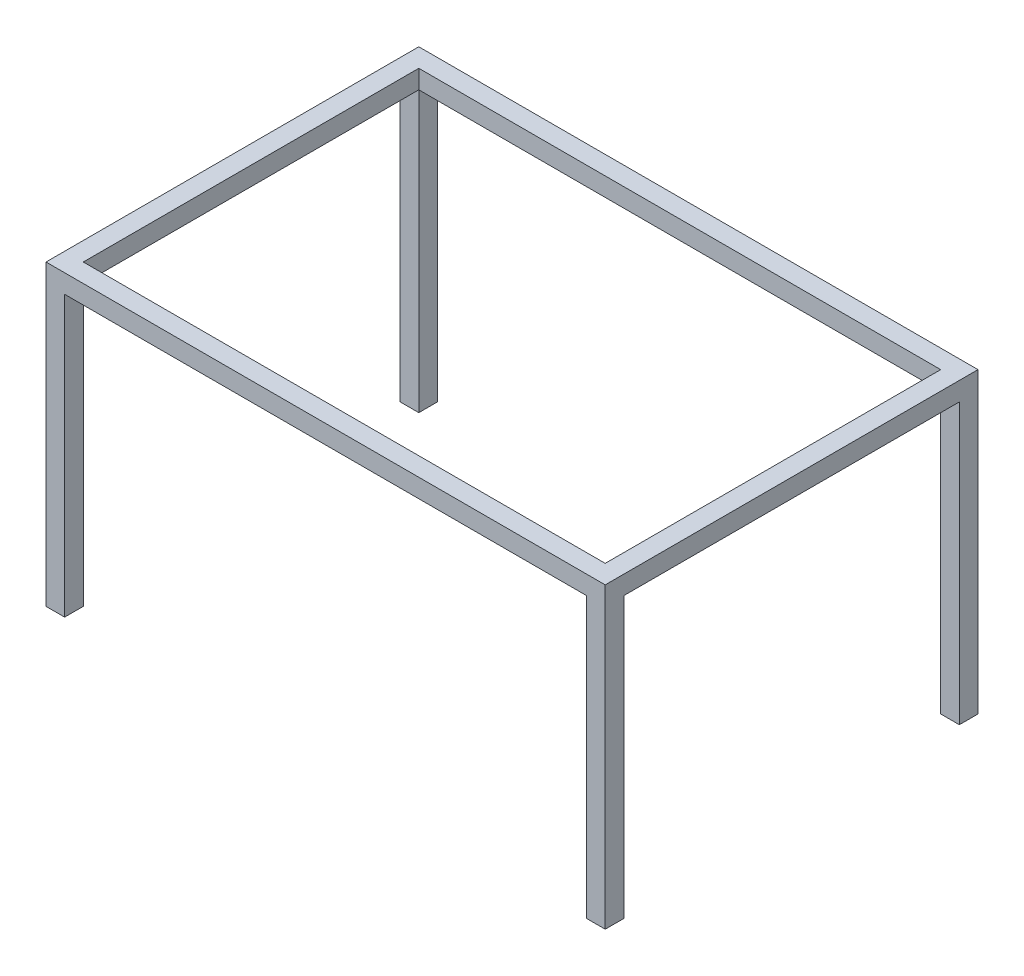
ISO-10303-21;
HEADER;
FILE_DESCRIPTION(('STEP AP214'),'2;1');
FILE_NAME('part.step','',(''),(''),'','','');
FILE_SCHEMA(('AUTOMOTIVE_DESIGN { 1 0 10303 214 1 1 1 1 }'));
ENDSEC;
DATA;
#1=APPLICATION_CONTEXT('core data for automotive mechanical design processes');
#2=APPLICATION_PROTOCOL_DEFINITION('international standard','automotive_design',2000,#1);
#3=PRODUCT_CONTEXT('',#1,'mechanical');
#4=PRODUCT('Part','Part','',(#3));
#5=PRODUCT_RELATED_PRODUCT_CATEGORY('part','',(#4));
#6=PRODUCT_DEFINITION_FORMATION('','',#4);
#7=PRODUCT_DEFINITION_CONTEXT('part definition',#1,'design');
#8=PRODUCT_DEFINITION('design','',#6,#7);
#9=PRODUCT_DEFINITION_SHAPE('','',#8);
#10=(LENGTH_UNIT() NAMED_UNIT(*) SI_UNIT(.MILLI.,.METRE.));
#11=(NAMED_UNIT(*) PLANE_ANGLE_UNIT() SI_UNIT($,.RADIAN.));
#12=(NAMED_UNIT(*) SI_UNIT($,.STERADIAN.) SOLID_ANGLE_UNIT());
#13=UNCERTAINTY_MEASURE_WITH_UNIT(LENGTH_MEASURE(1.E-05),#10,'distance_accuracy_value','');
#14=(GEOMETRIC_REPRESENTATION_CONTEXT(3) GLOBAL_UNCERTAINTY_ASSIGNED_CONTEXT((#13)) GLOBAL_UNIT_ASSIGNED_CONTEXT((#10,
#11,#12)) REPRESENTATION_CONTEXT('',''));
#15=CARTESIAN_POINT('',(0.,0.,0.));
#16=DIRECTION('',(0.,0.,1.));
#17=DIRECTION('',(1.,0.,0.));
#18=AXIS2_PLACEMENT_3D('',#15,#16,#17);
#19=CARTESIAN_POINT('',(0.,0.,0.));
#20=DIRECTION('',(0.,-1.,0.));
#21=DIRECTION('',(0.,0.,-1.));
#22=AXIS2_PLACEMENT_3D('',#19,#20,#21);
#23=PLANE('',#22);
#24=DIRECTION('',(1.,0.,0.));
#25=VECTOR('',#24,1.);
#26=CARTESIAN_POINT('',(-1400.,0.,900.));
#27=LINE('',#26,#25);
#28=CARTESIAN_POINT('',(-1400.,0.,900.));
#29=VERTEX_POINT('',#28);
#30=CARTESIAN_POINT('',(1400.,0.,900.));
#31=VERTEX_POINT('',#30);
#32=EDGE_CURVE('E269',#29,#31,#27,.T.);
#33=ORIENTED_EDGE('',*,*,#32,.T.);
#34=DIRECTION('',(0.,0.,-1.));
#35=VECTOR('',#34,1.);
#36=CARTESIAN_POINT('',(1400.,0.,900.));
#37=LINE('',#36,#35);
#38=CARTESIAN_POINT('',(1400.,0.,1000.));
#39=VERTEX_POINT('',#38);
#40=EDGE_CURVE('E182',#39,#31,#37,.T.);
#41=ORIENTED_EDGE('',*,*,#40,.F.);
#42=DIRECTION('',(1.,0.,0.));
#43=VECTOR('',#42,1.);
#44=CARTESIAN_POINT('',(-1500.,0.,1000.));
#45=LINE('',#44,#43);
#46=CARTESIAN_POINT('',(-1400.,0.,1000.));
#47=VERTEX_POINT('',#46);
#48=EDGE_CURVE('E293',#47,#39,#45,.T.);
#49=ORIENTED_EDGE('',*,*,#48,.F.);
#50=DIRECTION('',(0.,0.,1.));
#51=VECTOR('',#50,1.);
#52=CARTESIAN_POINT('',(-1400.,0.,1000.));
#53=LINE('',#52,#51);
#54=EDGE_CURVE('E236',#29,#47,#53,.T.);
#55=ORIENTED_EDGE('',*,*,#54,.F.);
#56=EDGE_LOOP('',(#33,#41,#49,#55));
#57=FACE_BOUND('',#56,.T.);
#58=ADVANCED_FACE('F33',(#57),#23,.T.);
#59=DIRECTION('',(0.,0.,-1.));
#60=VECTOR('',#59,1.);
#61=CARTESIAN_POINT('',(1500.,0.,1000.));
#62=LINE('',#61,#60);
#63=CARTESIAN_POINT('',(1500.,0.,900.));
#64=VERTEX_POINT('',#63);
#65=CARTESIAN_POINT('',(1500.,0.,-899.999999999999));
#66=VERTEX_POINT('',#65);
#67=EDGE_CURVE('E288',#64,#66,#62,.T.);
#68=ORIENTED_EDGE('',*,*,#67,.F.);
#69=DIRECTION('',(1.,0.,0.));
#70=VECTOR('',#69,1.);
#71=CARTESIAN_POINT('',(1400.,0.,900.));
#72=LINE('',#71,#70);
#73=EDGE_CURVE('E178',#31,#64,#72,.T.);
#74=ORIENTED_EDGE('',*,*,#73,.F.);
#75=DIRECTION('',(0.,0.,-1.));
#76=VECTOR('',#75,1.);
#77=CARTESIAN_POINT('',(1400.,0.,900.));
#78=LINE('',#77,#76);
#79=CARTESIAN_POINT('',(1400.,0.,-899.999999999999));
#80=VERTEX_POINT('',#79);
#81=EDGE_CURVE('E272',#31,#80,#78,.T.);
#82=ORIENTED_EDGE('',*,*,#81,.T.);
#83=DIRECTION('',(-1.,0.,0.));
#84=VECTOR('',#83,1.);
#85=CARTESIAN_POINT('',(1500.,0.,-899.999999999999));
#86=LINE('',#85,#84);
#87=EDGE_CURVE('E184',#66,#80,#86,.T.);
#88=ORIENTED_EDGE('',*,*,#87,.F.);
#89=EDGE_LOOP('',(#68,#74,#82,#88));
#90=FACE_BOUND('',#89,.T.);
#91=ADVANCED_FACE('F363',(#90),#23,.T.);
#92=DIRECTION('',(-1.,0.,0.));
#93=VECTOR('',#92,1.);
#94=CARTESIAN_POINT('',(-1500.,0.,-1000.));
#95=LINE('',#94,#93);
#96=CARTESIAN_POINT('',(1400.,0.,-1000.));
#97=VERTEX_POINT('',#96);
#98=CARTESIAN_POINT('',(-1400.,0.,-1000.));
#99=VERTEX_POINT('',#98);
#100=EDGE_CURVE('E301',#97,#99,#95,.T.);
#101=ORIENTED_EDGE('',*,*,#100,.F.);
#102=DIRECTION('',(0.,0.,-1.));
#103=VECTOR('',#102,1.);
#104=CARTESIAN_POINT('',(1400.,0.,-1000.));
#105=LINE('',#104,#103);
#106=EDGE_CURVE('E186',#80,#97,#105,.T.);
#107=ORIENTED_EDGE('',*,*,#106,.F.);
#108=DIRECTION('',(-1.,0.,0.));
#109=VECTOR('',#108,1.);
#110=CARTESIAN_POINT('',(-1400.,0.,-900.));
#111=LINE('',#110,#109);
#112=CARTESIAN_POINT('',(-1400.,0.,-900.));
#113=VERTEX_POINT('',#112);
#114=EDGE_CURVE('E260',#80,#113,#111,.T.);
#115=ORIENTED_EDGE('',*,*,#114,.T.);
#116=DIRECTION('',(0.,0.,1.));
#117=VECTOR('',#116,1.);
#118=CARTESIAN_POINT('',(-1400.,0.,-900.));
#119=LINE('',#118,#117);
#120=EDGE_CURVE('E210',#99,#113,#119,.T.);
#121=ORIENTED_EDGE('',*,*,#120,.F.);
#122=EDGE_LOOP('',(#101,#107,#115,#121));
#123=FACE_BOUND('',#122,.T.);
#124=ADVANCED_FACE('F398',(#123),#23,.T.);
#125=DIRECTION('',(0.,0.,1.));
#126=VECTOR('',#125,1.);
#127=CARTESIAN_POINT('',(-1500.,0.,1000.));
#128=LINE('',#127,#126);
#129=CARTESIAN_POINT('',(-1500.,0.,-899.999999999999));
#130=VERTEX_POINT('',#129);
#131=CARTESIAN_POINT('',(-1500.,0.,900.));
#132=VERTEX_POINT('',#131);
#133=EDGE_CURVE('E303',#130,#132,#128,.T.);
#134=ORIENTED_EDGE('',*,*,#133,.F.);
#135=DIRECTION('',(-1.,0.,0.));
#136=VECTOR('',#135,1.);
#137=CARTESIAN_POINT('',(-1400.,0.,-900.));
#138=LINE('',#137,#136);
#139=EDGE_CURVE('E215',#113,#130,#138,.T.);
#140=ORIENTED_EDGE('',*,*,#139,.F.);
#141=DIRECTION('',(0.,0.,1.));
#142=VECTOR('',#141,1.);
#143=CARTESIAN_POINT('',(-1400.,0.,900.));
#144=LINE('',#143,#142);
#145=EDGE_CURVE('E256',#113,#29,#144,.T.);
#146=ORIENTED_EDGE('',*,*,#145,.T.);
#147=DIRECTION('',(1.,0.,0.));
#148=VECTOR('',#147,1.);
#149=CARTESIAN_POINT('',(-1500.,0.,900.));
#150=LINE('',#149,#148);
#151=EDGE_CURVE('E231',#132,#29,#150,.T.);
#152=ORIENTED_EDGE('',*,*,#151,.F.);
#153=EDGE_LOOP('',(#134,#140,#146,#152));
#154=FACE_BOUND('',#153,.T.);
#155=ADVANCED_FACE('F331',(#154),#23,.T.);
#156=CARTESIAN_POINT('',(0.,100.,0.));
#157=DIRECTION('',(0.,-1.,0.));
#158=DIRECTION('',(0.,0.,-1.));
#159=AXIS2_PLACEMENT_3D('',#156,#157,#158);
#160=PLANE('',#159);
#161=DIRECTION('',(0.,0.,-1.));
#162=VECTOR('',#161,1.);
#163=CARTESIAN_POINT('',(1500.,100.,1000.));
#164=LINE('',#163,#162);
#165=CARTESIAN_POINT('',(1500.,100.,1000.));
#166=VERTEX_POINT('',#165);
#167=CARTESIAN_POINT('',(1500.,100.,-1000.));
#168=VERTEX_POINT('',#167);
#169=EDGE_CURVE('E289',#166,#168,#164,.T.);
#170=ORIENTED_EDGE('',*,*,#169,.T.);
#171=DIRECTION('',(-1.,0.,0.));
#172=VECTOR('',#171,1.);
#173=CARTESIAN_POINT('',(-1500.,100.,-1000.));
#174=LINE('',#173,#172);
#175=CARTESIAN_POINT('',(-1500.,100.,-1000.));
#176=VERTEX_POINT('',#175);
#177=EDGE_CURVE('E292',#168,#176,#174,.T.);
#178=ORIENTED_EDGE('',*,*,#177,.T.);
#179=DIRECTION('',(0.,0.,1.));
#180=VECTOR('',#179,1.);
#181=CARTESIAN_POINT('',(-1500.,100.,1000.));
#182=LINE('',#181,#180);
#183=CARTESIAN_POINT('',(-1500.,100.,1000.));
#184=VERTEX_POINT('',#183);
#185=EDGE_CURVE('E295',#176,#184,#182,.T.);
#186=ORIENTED_EDGE('',*,*,#185,.T.);
#187=DIRECTION('',(1.,0.,0.));
#188=VECTOR('',#187,1.);
#189=CARTESIAN_POINT('',(-1500.,100.,1000.));
#190=LINE('',#189,#188);
#191=EDGE_CURVE('E297',#184,#166,#190,.T.);
#192=ORIENTED_EDGE('',*,*,#191,.T.);
#193=EDGE_LOOP('',(#170,#178,#186,#192));
#194=FACE_BOUND('',#193,.T.);
#195=DIRECTION('',(0.,0.,1.));
#196=VECTOR('',#195,1.);
#197=CARTESIAN_POINT('',(-1400.,100.,900.));
#198=LINE('',#197,#196);
#199=CARTESIAN_POINT('',(-1400.,100.,-900.));
#200=VERTEX_POINT('',#199);
#201=CARTESIAN_POINT('',(-1400.,100.,900.));
#202=VERTEX_POINT('',#201);
#203=EDGE_CURVE('E257',#200,#202,#198,.T.);
#204=ORIENTED_EDGE('',*,*,#203,.F.);
#205=DIRECTION('',(-1.,0.,0.));
#206=VECTOR('',#205,1.);
#207=CARTESIAN_POINT('',(-1400.,100.,-900.));
#208=LINE('',#207,#206);
#209=CARTESIAN_POINT('',(1400.,100.,-899.999999999999));
#210=VERTEX_POINT('',#209);
#211=EDGE_CURVE('E265',#210,#200,#208,.T.);
#212=ORIENTED_EDGE('',*,*,#211,.F.);
#213=DIRECTION('',(0.,0.,-1.));
#214=VECTOR('',#213,1.);
#215=CARTESIAN_POINT('',(1400.,100.,900.));
#216=LINE('',#215,#214);
#217=CARTESIAN_POINT('',(1400.,100.,900.));
#218=VERTEX_POINT('',#217);
#219=EDGE_CURVE('E262',#218,#210,#216,.T.);
#220=ORIENTED_EDGE('',*,*,#219,.F.);
#221=DIRECTION('',(1.,0.,0.));
#222=VECTOR('',#221,1.);
#223=CARTESIAN_POINT('',(-1400.,100.,900.));
#224=LINE('',#223,#222);
#225=EDGE_CURVE('E259',#202,#218,#224,.T.);
#226=ORIENTED_EDGE('',*,*,#225,.F.);
#227=EDGE_LOOP('',(#204,#212,#220,#226));
#228=FACE_BOUND('',#227,.T.);
#229=ADVANCED_FACE('F348',(#194,#228),#160,.F.);
#230=CARTESIAN_POINT('',(1500.,100.,1000.));
#231=DIRECTION('',(-1.,0.,0.));
#232=DIRECTION('',(0.,0.,1.));
#233=AXIS2_PLACEMENT_3D('',#230,#231,#232);
#234=PLANE('',#233);
#235=DIRECTION('',(0.,-1.,0.));
#236=VECTOR('',#235,1.);
#237=CARTESIAN_POINT('',(1500.,100.,1000.));
#238=LINE('',#237,#236);
#239=CARTESIAN_POINT('',(1500.,-1500.,1000.));
#240=VERTEX_POINT('',#239);
#241=EDGE_CURVE('E299',#166,#240,#238,.T.);
#242=ORIENTED_EDGE('',*,*,#241,.T.);
#243=DIRECTION('',(0.,0.,1.));
#244=VECTOR('',#243,1.);
#245=CARTESIAN_POINT('',(1500.,-1500.,900.));
#246=LINE('',#245,#244);
#247=CARTESIAN_POINT('',(1500.,-1500.,900.));
#248=VERTEX_POINT('',#247);
#249=EDGE_CURVE('E169',#248,#240,#246,.T.);
#250=ORIENTED_EDGE('',*,*,#249,.F.);
#251=DIRECTION('',(0.,1.,0.));
#252=VECTOR('',#251,1.);
#253=CARTESIAN_POINT('',(1500.,-1500.,900.));
#254=LINE('',#253,#252);
#255=EDGE_CURVE('E165',#248,#64,#254,.T.);
#256=ORIENTED_EDGE('',*,*,#255,.T.);
#257=ORIENTED_EDGE('',*,*,#67,.T.);
#258=DIRECTION('',(0.,1.,0.));
#259=VECTOR('',#258,1.);
#260=CARTESIAN_POINT('',(1500.,-1500.,-899.999999999999));
#261=LINE('',#260,#259);
#262=CARTESIAN_POINT('',(1500.,-1500.,-899.999999999999));
#263=VERTEX_POINT('',#262);
#264=EDGE_CURVE('E207',#263,#66,#261,.T.);
#265=ORIENTED_EDGE('',*,*,#264,.F.);
#266=DIRECTION('',(0.,0.,1.));
#267=VECTOR('',#266,1.);
#268=CARTESIAN_POINT('',(1500.,-1500.,-1000.));
#269=LINE('',#268,#267);
#270=CARTESIAN_POINT('',(1500.,-1500.,-1000.));
#271=VERTEX_POINT('',#270);
#272=EDGE_CURVE('E192',#271,#263,#269,.T.);
#273=ORIENTED_EDGE('',*,*,#272,.F.);
#274=DIRECTION('',(0.,-1.,0.));
#275=VECTOR('',#274,1.);
#276=CARTESIAN_POINT('',(1500.,100.,-1000.));
#277=LINE('',#276,#275);
#278=EDGE_CURVE('E11',#168,#271,#277,.T.);
#279=ORIENTED_EDGE('',*,*,#278,.F.);
#280=ORIENTED_EDGE('',*,*,#169,.F.);
#281=EDGE_LOOP('',(#242,#250,#256,#257,#265,#273,#279,#280));
#282=FACE_BOUND('',#281,.T.);
#283=ADVANCED_FACE('F35',(#282),#234,.F.);
#284=CARTESIAN_POINT('',(-1500.,100.,-1000.));
#285=DIRECTION('',(0.,0.,1.));
#286=DIRECTION('',(1.,0.,0.));
#287=AXIS2_PLACEMENT_3D('',#284,#285,#286);
#288=PLANE('',#287);
#289=ORIENTED_EDGE('',*,*,#278,.T.);
#290=DIRECTION('',(1.,0.,0.));
#291=VECTOR('',#290,1.);
#292=CARTESIAN_POINT('',(1500.,-1500.,-1000.));
#293=LINE('',#292,#291);
#294=CARTESIAN_POINT('',(1400.,-1500.,-1000.));
#295=VERTEX_POINT('',#294);
#296=EDGE_CURVE('E199',#295,#271,#293,.T.);
#297=ORIENTED_EDGE('',*,*,#296,.F.);
#298=DIRECTION('',(0.,1.,0.));
#299=VECTOR('',#298,1.);
#300=CARTESIAN_POINT('',(1400.,-1500.,-1000.));
#301=LINE('',#300,#299);
#302=EDGE_CURVE('E48',#295,#97,#301,.T.);
#303=ORIENTED_EDGE('',*,*,#302,.T.);
#304=ORIENTED_EDGE('',*,*,#100,.T.);
#305=DIRECTION('',(0.,1.,0.));
#306=VECTOR('',#305,1.);
#307=CARTESIAN_POINT('',(-1400.,-1500.,-1000.));
#308=LINE('',#307,#306);
#309=CARTESIAN_POINT('',(-1400.,-1500.,-1000.));
#310=VERTEX_POINT('',#309);
#311=EDGE_CURVE('E222',#310,#99,#308,.T.);
#312=ORIENTED_EDGE('',*,*,#311,.F.);
#313=DIRECTION('',(1.,0.,0.));
#314=VECTOR('',#313,1.);
#315=CARTESIAN_POINT('',(-1400.,-1500.,-1000.));
#316=LINE('',#315,#314);
#317=CARTESIAN_POINT('',(-1500.,-1500.,-1000.));
#318=VERTEX_POINT('',#317);
#319=EDGE_CURVE('E220',#318,#310,#316,.T.);
#320=ORIENTED_EDGE('',*,*,#319,.F.);
#321=DIRECTION('',(0.,-1.,0.));
#322=VECTOR('',#321,1.);
#323=CARTESIAN_POINT('',(-1500.,100.,-1000.));
#324=LINE('',#323,#322);
#325=EDGE_CURVE('E41',#176,#318,#324,.T.);
#326=ORIENTED_EDGE('',*,*,#325,.F.);
#327=ORIENTED_EDGE('',*,*,#177,.F.);
#328=EDGE_LOOP('',(#289,#297,#303,#304,#312,#320,#326,#327));
#329=FACE_BOUND('',#328,.T.);
#330=ADVANCED_FACE('F317',(#329),#288,.F.);
#331=CARTESIAN_POINT('',(-1500.,100.,1000.));
#332=DIRECTION('',(1.,0.,0.));
#333=DIRECTION('',(0.,0.,-1.));
#334=AXIS2_PLACEMENT_3D('',#331,#332,#333);
#335=PLANE('',#334);
#336=ORIENTED_EDGE('',*,*,#325,.T.);
#337=DIRECTION('',(0.,0.,-1.));
#338=VECTOR('',#337,1.);
#339=CARTESIAN_POINT('',(-1500.,-1500.,-900.));
#340=LINE('',#339,#338);
#341=CARTESIAN_POINT('',(-1500.,-1500.,-900.));
#342=VERTEX_POINT('',#341);
#343=EDGE_CURVE('E217',#342,#318,#340,.T.);
#344=ORIENTED_EDGE('',*,*,#343,.F.);
#345=DIRECTION('',(0.,1.,0.));
#346=VECTOR('',#345,1.);
#347=CARTESIAN_POINT('',(-1500.,-1500.,-900.));
#348=LINE('',#347,#346);
#349=EDGE_CURVE('E56',#342,#130,#348,.T.);
#350=ORIENTED_EDGE('',*,*,#349,.T.);
#351=ORIENTED_EDGE('',*,*,#133,.T.);
#352=DIRECTION('',(0.,1.,0.));
#353=VECTOR('',#352,1.);
#354=CARTESIAN_POINT('',(-1500.,-1500.,900.));
#355=LINE('',#354,#353);
#356=CARTESIAN_POINT('',(-1500.,-1500.,900.));
#357=VERTEX_POINT('',#356);
#358=EDGE_CURVE('E253',#357,#132,#355,.T.);
#359=ORIENTED_EDGE('',*,*,#358,.F.);
#360=DIRECTION('',(0.,0.,-1.));
#361=VECTOR('',#360,1.);
#362=CARTESIAN_POINT('',(-1500.,-1500.,1000.));
#363=LINE('',#362,#361);
#364=CARTESIAN_POINT('',(-1500.,-1500.,1000.));
#365=VERTEX_POINT('',#364);
#366=EDGE_CURVE('E232',#365,#357,#363,.T.);
#367=ORIENTED_EDGE('',*,*,#366,.F.);
#368=DIRECTION('',(0.,-1.,0.));
#369=VECTOR('',#368,1.);
#370=CARTESIAN_POINT('',(-1500.,100.,1000.));
#371=LINE('',#370,#369);
#372=EDGE_CURVE('E308',#184,#365,#371,.T.);
#373=ORIENTED_EDGE('',*,*,#372,.F.);
#374=ORIENTED_EDGE('',*,*,#185,.F.);
#375=EDGE_LOOP('',(#336,#344,#350,#351,#359,#367,#373,#374));
#376=FACE_BOUND('',#375,.T.);
#377=ADVANCED_FACE('F311',(#376),#335,.F.);
#378=CARTESIAN_POINT('',(-1500.,100.,1000.));
#379=DIRECTION('',(0.,0.,-1.));
#380=DIRECTION('',(-1.,0.,0.));
#381=AXIS2_PLACEMENT_3D('',#378,#379,#380);
#382=PLANE('',#381);
#383=ORIENTED_EDGE('',*,*,#372,.T.);
#384=DIRECTION('',(-1.,0.,0.));
#385=VECTOR('',#384,1.);
#386=CARTESIAN_POINT('',(-1500.,-1500.,1000.));
#387=LINE('',#386,#385);
#388=CARTESIAN_POINT('',(-1400.,-1500.,1000.));
#389=VERTEX_POINT('',#388);
#390=EDGE_CURVE('E240',#389,#365,#387,.T.);
#391=ORIENTED_EDGE('',*,*,#390,.F.);
#392=DIRECTION('',(0.,1.,0.));
#393=VECTOR('',#392,1.);
#394=CARTESIAN_POINT('',(-1400.,-1500.,1000.));
#395=LINE('',#394,#393);
#396=EDGE_CURVE('E243',#389,#47,#395,.T.);
#397=ORIENTED_EDGE('',*,*,#396,.T.);
#398=ORIENTED_EDGE('',*,*,#48,.T.);
#399=DIRECTION('',(0.,1.,0.));
#400=VECTOR('',#399,1.);
#401=CARTESIAN_POINT('',(1400.,-1500.,1000.));
#402=LINE('',#401,#400);
#403=CARTESIAN_POINT('',(1400.,-1500.,1000.));
#404=VERTEX_POINT('',#403);
#405=EDGE_CURVE('E188',#404,#39,#402,.T.);
#406=ORIENTED_EDGE('',*,*,#405,.F.);
#407=DIRECTION('',(-1.,0.,0.));
#408=VECTOR('',#407,1.);
#409=CARTESIAN_POINT('',(1400.,-1500.,1000.));
#410=LINE('',#409,#408);
#411=EDGE_CURVE('E175',#240,#404,#410,.T.);
#412=ORIENTED_EDGE('',*,*,#411,.F.);
#413=ORIENTED_EDGE('',*,*,#241,.F.);
#414=ORIENTED_EDGE('',*,*,#191,.F.);
#415=EDGE_LOOP('',(#383,#391,#397,#398,#406,#412,#413,#414));
#416=FACE_BOUND('',#415,.T.);
#417=ADVANCED_FACE('F343',(#416),#382,.F.);
#418=CARTESIAN_POINT('',(-1400.,100.,900.));
#419=DIRECTION('',(1.,0.,0.));
#420=DIRECTION('',(0.,0.,-1.));
#421=AXIS2_PLACEMENT_3D('',#418,#419,#420);
#422=PLANE('',#421);
#423=ORIENTED_EDGE('',*,*,#145,.F.);
#424=DIRECTION('',(0.,-1.,0.));
#425=VECTOR('',#424,1.);
#426=CARTESIAN_POINT('',(-1400.,100.,-900.));
#427=LINE('',#426,#425);
#428=EDGE_CURVE('E267',#200,#113,#427,.T.);
#429=ORIENTED_EDGE('',*,*,#428,.F.);
#430=ORIENTED_EDGE('',*,*,#203,.T.);
#431=DIRECTION('',(0.,-1.,0.));
#432=VECTOR('',#431,1.);
#433=CARTESIAN_POINT('',(-1400.,100.,900.));
#434=LINE('',#433,#432);
#435=EDGE_CURVE('E285',#202,#29,#434,.T.);
#436=ORIENTED_EDGE('',*,*,#435,.T.);
#437=EDGE_LOOP('',(#423,#429,#430,#436));
#438=FACE_BOUND('',#437,.T.);
#439=ADVANCED_FACE('F383',(#438),#422,.T.);
#440=CARTESIAN_POINT('',(-1400.,100.,900.));
#441=DIRECTION('',(0.,0.,-1.));
#442=DIRECTION('',(-1.,0.,0.));
#443=AXIS2_PLACEMENT_3D('',#440,#441,#442);
#444=PLANE('',#443);
#445=ORIENTED_EDGE('',*,*,#32,.F.);
#446=ORIENTED_EDGE('',*,*,#435,.F.);
#447=ORIENTED_EDGE('',*,*,#225,.T.);
#448=DIRECTION('',(0.,-1.,0.));
#449=VECTOR('',#448,1.);
#450=CARTESIAN_POINT('',(1400.,100.,900.));
#451=LINE('',#450,#449);
#452=EDGE_CURVE('E282',#218,#31,#451,.T.);
#453=ORIENTED_EDGE('',*,*,#452,.T.);
#454=EDGE_LOOP('',(#445,#446,#447,#453));
#455=FACE_BOUND('',#454,.T.);
#456=ADVANCED_FACE('F375',(#455),#444,.T.);
#457=CARTESIAN_POINT('',(1400.,100.,900.));
#458=DIRECTION('',(-1.,0.,0.));
#459=DIRECTION('',(0.,0.,1.));
#460=AXIS2_PLACEMENT_3D('',#457,#458,#459);
#461=PLANE('',#460);
#462=ORIENTED_EDGE('',*,*,#81,.F.);
#463=ORIENTED_EDGE('',*,*,#452,.F.);
#464=ORIENTED_EDGE('',*,*,#219,.T.);
#465=DIRECTION('',(0.,-1.,0.));
#466=VECTOR('',#465,1.);
#467=CARTESIAN_POINT('',(1400.,100.,-899.999999999999));
#468=LINE('',#467,#466);
#469=EDGE_CURVE('E279',#210,#80,#468,.T.);
#470=ORIENTED_EDGE('',*,*,#469,.T.);
#471=EDGE_LOOP('',(#462,#463,#464,#470));
#472=FACE_BOUND('',#471,.T.);
#473=ADVANCED_FACE('F367',(#472),#461,.T.);
#474=CARTESIAN_POINT('',(-1400.,100.,-900.));
#475=DIRECTION('',(0.,0.,1.));
#476=DIRECTION('',(1.,0.,0.));
#477=AXIS2_PLACEMENT_3D('',#474,#475,#476);
#478=PLANE('',#477);
#479=ORIENTED_EDGE('',*,*,#114,.F.);
#480=ORIENTED_EDGE('',*,*,#469,.F.);
#481=ORIENTED_EDGE('',*,*,#211,.T.);
#482=ORIENTED_EDGE('',*,*,#428,.T.);
#483=EDGE_LOOP('',(#479,#480,#481,#482));
#484=FACE_BOUND('',#483,.T.);
#485=ADVANCED_FACE('F381',(#484),#478,.T.);
#486=CARTESIAN_POINT('',(-1500.,-1500.,900.));
#487=DIRECTION('',(0.,0.,1.));
#488=DIRECTION('',(1.,0.,0.));
#489=AXIS2_PLACEMENT_3D('',#486,#487,#488);
#490=PLANE('',#489);
#491=ORIENTED_EDGE('',*,*,#151,.T.);
#492=DIRECTION('',(0.,1.,0.));
#493=VECTOR('',#492,1.);
#494=CARTESIAN_POINT('',(-1400.,-1500.,900.));
#495=LINE('',#494,#493);
#496=CARTESIAN_POINT('',(-1400.,-1500.,900.));
#497=VERTEX_POINT('',#496);
#498=EDGE_CURVE('E250',#497,#29,#495,.T.);
#499=ORIENTED_EDGE('',*,*,#498,.F.);
#500=DIRECTION('',(1.,0.,0.));
#501=VECTOR('',#500,1.);
#502=CARTESIAN_POINT('',(-1500.,-1500.,900.));
#503=LINE('',#502,#501);
#504=EDGE_CURVE('E235',#357,#497,#503,.T.);
#505=ORIENTED_EDGE('',*,*,#504,.F.);
#506=ORIENTED_EDGE('',*,*,#358,.T.);
#507=EDGE_LOOP('',(#491,#499,#505,#506));
#508=FACE_BOUND('',#507,.T.);
#509=ADVANCED_FACE('F335',(#508),#490,.F.);
#510=CARTESIAN_POINT('',(-1400.,-1500.,1000.));
#511=DIRECTION('',(-1.,0.,0.));
#512=DIRECTION('',(0.,0.,1.));
#513=AXIS2_PLACEMENT_3D('',#510,#511,#512);
#514=PLANE('',#513);
#515=ORIENTED_EDGE('',*,*,#54,.T.);
#516=ORIENTED_EDGE('',*,*,#396,.F.);
#517=DIRECTION('',(0.,0.,1.));
#518=VECTOR('',#517,1.);
#519=CARTESIAN_POINT('',(-1400.,-1500.,1000.));
#520=LINE('',#519,#518);
#521=EDGE_CURVE('E238',#497,#389,#520,.T.);
#522=ORIENTED_EDGE('',*,*,#521,.F.);
#523=ORIENTED_EDGE('',*,*,#498,.T.);
#524=EDGE_LOOP('',(#515,#516,#522,#523));
#525=FACE_BOUND('',#524,.T.);
#526=ADVANCED_FACE('F428',(#525),#514,.F.);
#527=CARTESIAN_POINT('',(0.,-1500.,0.));
#528=DIRECTION('',(0.,-1.,0.));
#529=DIRECTION('',(0.,0.,-1.));
#530=AXIS2_PLACEMENT_3D('',#527,#528,#529);
#531=PLANE('',#530);
#532=ORIENTED_EDGE('',*,*,#366,.T.);
#533=ORIENTED_EDGE('',*,*,#504,.T.);
#534=ORIENTED_EDGE('',*,*,#521,.T.);
#535=ORIENTED_EDGE('',*,*,#390,.T.);
#536=EDGE_LOOP('',(#532,#533,#534,#535));
#537=FACE_BOUND('',#536,.T.);
#538=ADVANCED_FACE('F339',(#537),#531,.T.);
#539=CARTESIAN_POINT('',(-1400.,-1500.,-900.));
#540=DIRECTION('',(-1.,0.,0.));
#541=DIRECTION('',(0.,0.,1.));
#542=AXIS2_PLACEMENT_3D('',#539,#540,#541);
#543=PLANE('',#542);
#544=ORIENTED_EDGE('',*,*,#120,.T.);
#545=DIRECTION('',(0.,1.,0.));
#546=VECTOR('',#545,1.);
#547=CARTESIAN_POINT('',(-1400.,-1500.,-900.));
#548=LINE('',#547,#546);
#549=CARTESIAN_POINT('',(-1400.,-1500.,-900.));
#550=VERTEX_POINT('',#549);
#551=EDGE_CURVE('E229',#550,#113,#548,.T.);
#552=ORIENTED_EDGE('',*,*,#551,.F.);
#553=DIRECTION('',(0.,0.,1.));
#554=VECTOR('',#553,1.);
#555=CARTESIAN_POINT('',(-1400.,-1500.,-900.));
#556=LINE('',#555,#554);
#557=EDGE_CURVE('E211',#310,#550,#556,.T.);
#558=ORIENTED_EDGE('',*,*,#557,.F.);
#559=ORIENTED_EDGE('',*,*,#311,.T.);
#560=EDGE_LOOP('',(#544,#552,#558,#559));
#561=FACE_BOUND('',#560,.T.);
#562=ADVANCED_FACE('F323',(#561),#543,.F.);
#563=CARTESIAN_POINT('',(-1400.,-1500.,-900.));
#564=DIRECTION('',(0.,0.,-1.));
#565=DIRECTION('',(-1.,0.,0.));
#566=AXIS2_PLACEMENT_3D('',#563,#564,#565);
#567=PLANE('',#566);
#568=ORIENTED_EDGE('',*,*,#139,.T.);
#569=ORIENTED_EDGE('',*,*,#349,.F.);
#570=DIRECTION('',(-1.,0.,0.));
#571=VECTOR('',#570,1.);
#572=CARTESIAN_POINT('',(-1400.,-1500.,-900.));
#573=LINE('',#572,#571);
#574=EDGE_CURVE('E214',#550,#342,#573,.T.);
#575=ORIENTED_EDGE('',*,*,#574,.F.);
#576=ORIENTED_EDGE('',*,*,#551,.T.);
#577=EDGE_LOOP('',(#568,#569,#575,#576));
#578=FACE_BOUND('',#577,.T.);
#579=ADVANCED_FACE('F326',(#578),#567,.F.);
#580=CARTESIAN_POINT('',(0.,-1500.,0.));
#581=DIRECTION('',(0.,1.,0.));
#582=DIRECTION('',(0.,0.,1.));
#583=AXIS2_PLACEMENT_3D('',#580,#581,#582);
#584=PLANE('',#583);
#585=ORIENTED_EDGE('',*,*,#557,.T.);
#586=ORIENTED_EDGE('',*,*,#574,.T.);
#587=ORIENTED_EDGE('',*,*,#343,.T.);
#588=ORIENTED_EDGE('',*,*,#319,.T.);
#589=EDGE_LOOP('',(#585,#586,#587,#588));
#590=FACE_BOUND('',#589,.T.);
#591=ADVANCED_FACE('F315',(#590),#584,.F.);
#592=CARTESIAN_POINT('',(1500.,-1500.,-899.999999999999));
#593=DIRECTION('',(0.,0.,-1.));
#594=DIRECTION('',(-1.,0.,0.));
#595=AXIS2_PLACEMENT_3D('',#592,#593,#594);
#596=PLANE('',#595);
#597=ORIENTED_EDGE('',*,*,#87,.T.);
#598=DIRECTION('',(0.,1.,0.));
#599=VECTOR('',#598,1.);
#600=CARTESIAN_POINT('',(1400.,-1500.,-899.999999999999));
#601=LINE('',#600,#599);
#602=CARTESIAN_POINT('',(1400.,-1500.,-899.999999999999));
#603=VERTEX_POINT('',#602);
#604=EDGE_CURVE('E204',#603,#80,#601,.T.);
#605=ORIENTED_EDGE('',*,*,#604,.F.);
#606=DIRECTION('',(-1.,0.,0.));
#607=VECTOR('',#606,1.);
#608=CARTESIAN_POINT('',(1500.,-1500.,-899.999999999999));
#609=LINE('',#608,#607);
#610=EDGE_CURVE('E195',#263,#603,#609,.T.);
#611=ORIENTED_EDGE('',*,*,#610,.F.);
#612=ORIENTED_EDGE('',*,*,#264,.T.);
#613=EDGE_LOOP('',(#597,#605,#611,#612));
#614=FACE_BOUND('',#613,.T.);
#615=ADVANCED_FACE('F360',(#614),#596,.F.);
#616=CARTESIAN_POINT('',(1400.,-1500.,-1000.));
#617=DIRECTION('',(1.,0.,0.));
#618=DIRECTION('',(0.,0.,-1.));
#619=AXIS2_PLACEMENT_3D('',#616,#617,#618);
#620=PLANE('',#619);
#621=ORIENTED_EDGE('',*,*,#106,.T.);
#622=ORIENTED_EDGE('',*,*,#302,.F.);
#623=DIRECTION('',(0.,0.,-1.));
#624=VECTOR('',#623,1.);
#625=CARTESIAN_POINT('',(1400.,-1500.,-1000.));
#626=LINE('',#625,#624);
#627=EDGE_CURVE('E197',#603,#295,#626,.T.);
#628=ORIENTED_EDGE('',*,*,#627,.F.);
#629=ORIENTED_EDGE('',*,*,#604,.T.);
#630=EDGE_LOOP('',(#621,#622,#628,#629));
#631=FACE_BOUND('',#630,.T.);
#632=ADVANCED_FACE('F409',(#631),#620,.F.);
#633=CARTESIAN_POINT('',(0.,-1500.,0.));
#634=DIRECTION('',(0.,-1.,0.));
#635=DIRECTION('',(0.,0.,-1.));
#636=AXIS2_PLACEMENT_3D('',#633,#634,#635);
#637=PLANE('',#636);
#638=ORIENTED_EDGE('',*,*,#272,.T.);
#639=ORIENTED_EDGE('',*,*,#610,.T.);
#640=ORIENTED_EDGE('',*,*,#627,.T.);
#641=ORIENTED_EDGE('',*,*,#296,.T.);
#642=EDGE_LOOP('',(#638,#639,#640,#641));
#643=FACE_BOUND('',#642,.T.);
#644=ADVANCED_FACE('F354',(#643),#637,.T.);
#645=CARTESIAN_POINT('',(1400.,-1500.,900.));
#646=DIRECTION('',(1.,0.,0.));
#647=DIRECTION('',(0.,0.,-1.));
#648=AXIS2_PLACEMENT_3D('',#645,#646,#647);
#649=PLANE('',#648);
#650=ORIENTED_EDGE('',*,*,#40,.T.);
#651=DIRECTION('',(0.,1.,0.));
#652=VECTOR('',#651,1.);
#653=CARTESIAN_POINT('',(1400.,-1500.,900.));
#654=LINE('',#653,#652);
#655=CARTESIAN_POINT('',(1400.,-1500.,900.));
#656=VERTEX_POINT('',#655);
#657=EDGE_CURVE('E162',#656,#31,#654,.T.);
#658=ORIENTED_EDGE('',*,*,#657,.F.);
#659=DIRECTION('',(0.,0.,-1.));
#660=VECTOR('',#659,1.);
#661=CARTESIAN_POINT('',(1400.,-1500.,900.));
#662=LINE('',#661,#660);
#663=EDGE_CURVE('E170',#404,#656,#662,.T.);
#664=ORIENTED_EDGE('',*,*,#663,.F.);
#665=ORIENTED_EDGE('',*,*,#405,.T.);
#666=EDGE_LOOP('',(#650,#658,#664,#665));
#667=FACE_BOUND('',#666,.T.);
#668=ADVANCED_FACE('F180',(#667),#649,.F.);
#669=CARTESIAN_POINT('',(1400.,-1500.,900.));
#670=DIRECTION('',(0.,0.,1.));
#671=DIRECTION('',(1.,0.,0.));
#672=AXIS2_PLACEMENT_3D('',#669,#670,#671);
#673=PLANE('',#672);
#674=ORIENTED_EDGE('',*,*,#73,.T.);
#675=ORIENTED_EDGE('',*,*,#255,.F.);
#676=DIRECTION('',(1.,0.,0.));
#677=VECTOR('',#676,1.);
#678=CARTESIAN_POINT('',(1400.,-1500.,900.));
#679=LINE('',#678,#677);
#680=EDGE_CURVE('E158',#656,#248,#679,.T.);
#681=ORIENTED_EDGE('',*,*,#680,.F.);
#682=ORIENTED_EDGE('',*,*,#657,.T.);
#683=EDGE_LOOP('',(#674,#675,#681,#682));
#684=FACE_BOUND('',#683,.T.);
#685=ADVANCED_FACE('F160',(#684),#673,.F.);
#686=CARTESIAN_POINT('',(0.,-1500.,0.));
#687=DIRECTION('',(0.,1.,0.));
#688=DIRECTION('',(0.,0.,1.));
#689=AXIS2_PLACEMENT_3D('',#686,#687,#688);
#690=PLANE('',#689);
#691=ORIENTED_EDGE('',*,*,#663,.T.);
#692=ORIENTED_EDGE('',*,*,#680,.T.);
#693=ORIENTED_EDGE('',*,*,#249,.T.);
#694=ORIENTED_EDGE('',*,*,#411,.T.);
#695=EDGE_LOOP('',(#691,#692,#693,#694));
#696=FACE_BOUND('',#695,.T.);
#697=ADVANCED_FACE('F173',(#696),#690,.F.);
#698=CLOSED_SHELL('',(#58,#91,#124,#155,#229,#283,#330,#377,#417,#439,#456,#473,#485,#509,#526,
#538,#562,#579,#591,#615,#632,#644,#668,#685,#697));
#699=MANIFOLD_SOLID_BREP('B2',#698);
#700=ADVANCED_BREP_SHAPE_REPRESENTATION('',(#18,#699),#14);
#701=SHAPE_DEFINITION_REPRESENTATION(#9,#700);
ENDSEC;
END-ISO-10303-21;
